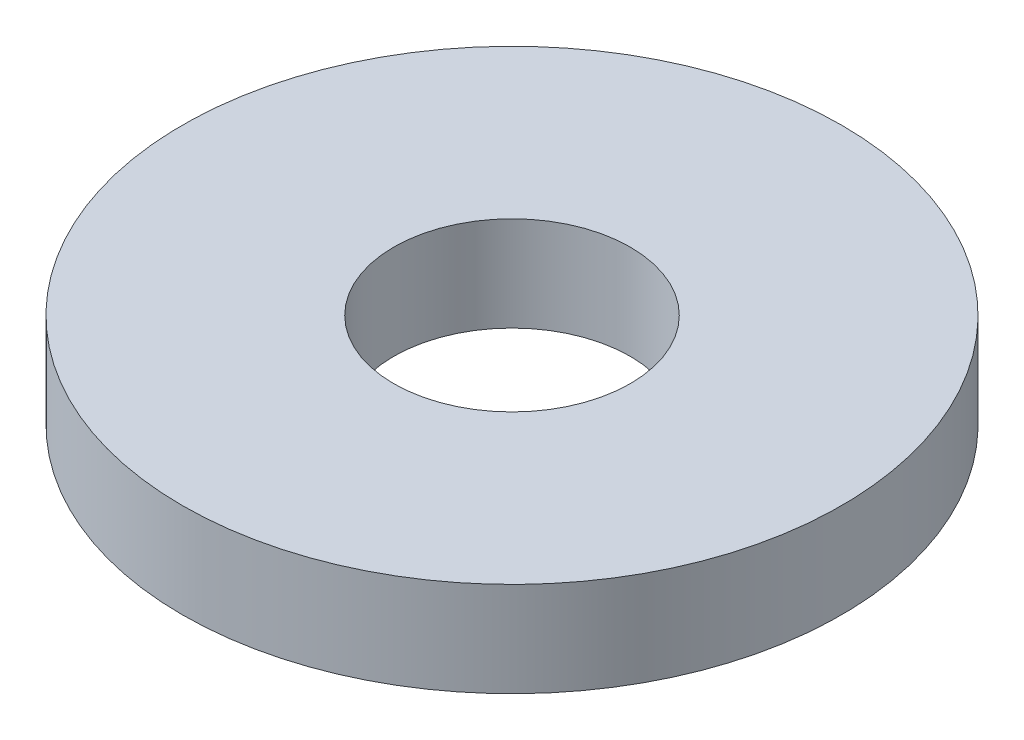
ISO-10303-21;
HEADER;
FILE_DESCRIPTION(('STEP AP214'),'2;1');
FILE_NAME('part.step','',(''),(''),'','','');
FILE_SCHEMA(('AUTOMOTIVE_DESIGN { 1 0 10303 214 1 1 1 1 }'));
ENDSEC;
DATA;
#1=APPLICATION_CONTEXT('core data for automotive mechanical design processes');
#2=APPLICATION_PROTOCOL_DEFINITION('international standard','automotive_design',2000,#1);
#3=PRODUCT_CONTEXT('',#1,'mechanical');
#4=PRODUCT('Part','Part','',(#3));
#5=PRODUCT_RELATED_PRODUCT_CATEGORY('part','',(#4));
#6=PRODUCT_DEFINITION_FORMATION('','',#4);
#7=PRODUCT_DEFINITION_CONTEXT('part definition',#1,'design');
#8=PRODUCT_DEFINITION('design','',#6,#7);
#9=PRODUCT_DEFINITION_SHAPE('','',#8);
#10=(LENGTH_UNIT() NAMED_UNIT(*) SI_UNIT(.MILLI.,.METRE.));
#11=(NAMED_UNIT(*) PLANE_ANGLE_UNIT() SI_UNIT($,.RADIAN.));
#12=(NAMED_UNIT(*) SI_UNIT($,.STERADIAN.) SOLID_ANGLE_UNIT());
#13=UNCERTAINTY_MEASURE_WITH_UNIT(LENGTH_MEASURE(1.E-05),#10,'distance_accuracy_value','');
#14=(GEOMETRIC_REPRESENTATION_CONTEXT(3) GLOBAL_UNCERTAINTY_ASSIGNED_CONTEXT((#13)) GLOBAL_UNIT_ASSIGNED_CONTEXT((#10,
#11,#12)) REPRESENTATION_CONTEXT('',''));
#15=CARTESIAN_POINT('',(0.,0.,0.));
#16=DIRECTION('',(0.,0.,1.));
#17=DIRECTION('',(1.,0.,0.));
#18=AXIS2_PLACEMENT_3D('',#15,#16,#17);
#19=CARTESIAN_POINT('',(0.,28.,0.));
#20=DIRECTION('',(0.,-1.,0.));
#21=DIRECTION('',(0.,0.,-1.));
#22=AXIS2_PLACEMENT_3D('',#19,#20,#21);
#23=CYLINDRICAL_SURFACE('',#22,97.5);
#24=CARTESIAN_POINT('',(0.,28.,0.));
#25=DIRECTION('',(0.,1.,0.));
#26=DIRECTION('',(0.,0.,1.));
#27=AXIS2_PLACEMENT_3D('',#24,#25,#26);
#28=CIRCLE('',#27,97.5);
#29=CARTESIAN_POINT('',(0.,28.,97.5));
#30=VERTEX_POINT('',#29);
#31=EDGE_CURVE('E10',#30,#30,#28,.T.);
#32=ORIENTED_EDGE('',*,*,#31,.F.);
#33=EDGE_LOOP('',(#32));
#34=FACE_BOUND('',#33,.T.);
#35=CARTESIAN_POINT('',(0.,0.,0.));
#36=DIRECTION('',(0.,1.,0.));
#37=DIRECTION('',(0.,0.,1.));
#38=AXIS2_PLACEMENT_3D('',#35,#36,#37);
#39=CIRCLE('',#38,97.5);
#40=CARTESIAN_POINT('',(0.,0.,97.5));
#41=VERTEX_POINT('',#40);
#42=EDGE_CURVE('E37',#41,#41,#39,.T.);
#43=ORIENTED_EDGE('',*,*,#42,.T.);
#44=EDGE_LOOP('',(#43));
#45=FACE_BOUND('',#44,.T.);
#46=ADVANCED_FACE('F40',(#34,#45),#23,.T.);
#47=CARTESIAN_POINT('',(0.,28.,0.));
#48=DIRECTION('',(0.,1.,0.));
#49=DIRECTION('',(0.,0.,1.));
#50=AXIS2_PLACEMENT_3D('',#47,#48,#49);
#51=PLANE('',#50);
#52=CARTESIAN_POINT('',(0.,28.,0.));
#53=DIRECTION('',(0.,1.,0.));
#54=DIRECTION('',(0.,0.,1.));
#55=AXIS2_PLACEMENT_3D('',#52,#53,#54);
#56=CIRCLE('',#55,35.);
#57=CARTESIAN_POINT('',(0.,28.,35.));
#58=VERTEX_POINT('',#57);
#59=EDGE_CURVE('E50',#58,#58,#56,.T.);
#60=ORIENTED_EDGE('',*,*,#59,.F.);
#61=EDGE_LOOP('',(#60));
#62=FACE_BOUND('',#61,.T.);
#63=ORIENTED_EDGE('',*,*,#31,.T.);
#64=EDGE_LOOP('',(#63));
#65=FACE_BOUND('',#64,.T.);
#66=ADVANCED_FACE('F59',(#62,#65),#51,.T.);
#67=CARTESIAN_POINT('',(0.,0.,0.));
#68=DIRECTION('',(0.,1.,0.));
#69=DIRECTION('',(0.,0.,1.));
#70=AXIS2_PLACEMENT_3D('',#67,#68,#69);
#71=PLANE('',#70);
#72=CARTESIAN_POINT('',(0.,0.,0.));
#73=DIRECTION('',(0.,1.,0.));
#74=DIRECTION('',(0.,0.,1.));
#75=AXIS2_PLACEMENT_3D('',#72,#73,#74);
#76=CIRCLE('',#75,35.);
#77=CARTESIAN_POINT('',(0.,0.,35.));
#78=VERTEX_POINT('',#77);
#79=EDGE_CURVE('E47',#78,#78,#76,.T.);
#80=ORIENTED_EDGE('',*,*,#79,.T.);
#81=EDGE_LOOP('',(#80));
#82=FACE_BOUND('',#81,.T.);
#83=ORIENTED_EDGE('',*,*,#42,.F.);
#84=EDGE_LOOP('',(#83));
#85=FACE_BOUND('',#84,.T.);
#86=ADVANCED_FACE('F58',(#82,#85),#71,.F.);
#87=CARTESIAN_POINT('',(0.,28.,0.));
#88=DIRECTION('',(0.,-1.,0.));
#89=DIRECTION('',(0.,0.,-1.));
#90=AXIS2_PLACEMENT_3D('',#87,#88,#89);
#91=CYLINDRICAL_SURFACE('',#90,35.);
#92=ORIENTED_EDGE('',*,*,#59,.T.);
#93=EDGE_LOOP('',(#92));
#94=FACE_BOUND('',#93,.T.);
#95=ORIENTED_EDGE('',*,*,#79,.F.);
#96=EDGE_LOOP('',(#95));
#97=FACE_BOUND('',#96,.T.);
#98=ADVANCED_FACE('F54',(#94,#97),#91,.F.);
#99=CLOSED_SHELL('',(#46,#66,#86,#98));
#100=MANIFOLD_SOLID_BREP('B2',#99);
#101=ADVANCED_BREP_SHAPE_REPRESENTATION('',(#18,#100),#14);
#102=SHAPE_DEFINITION_REPRESENTATION(#9,#101);
ENDSEC;
END-ISO-10303-21;
